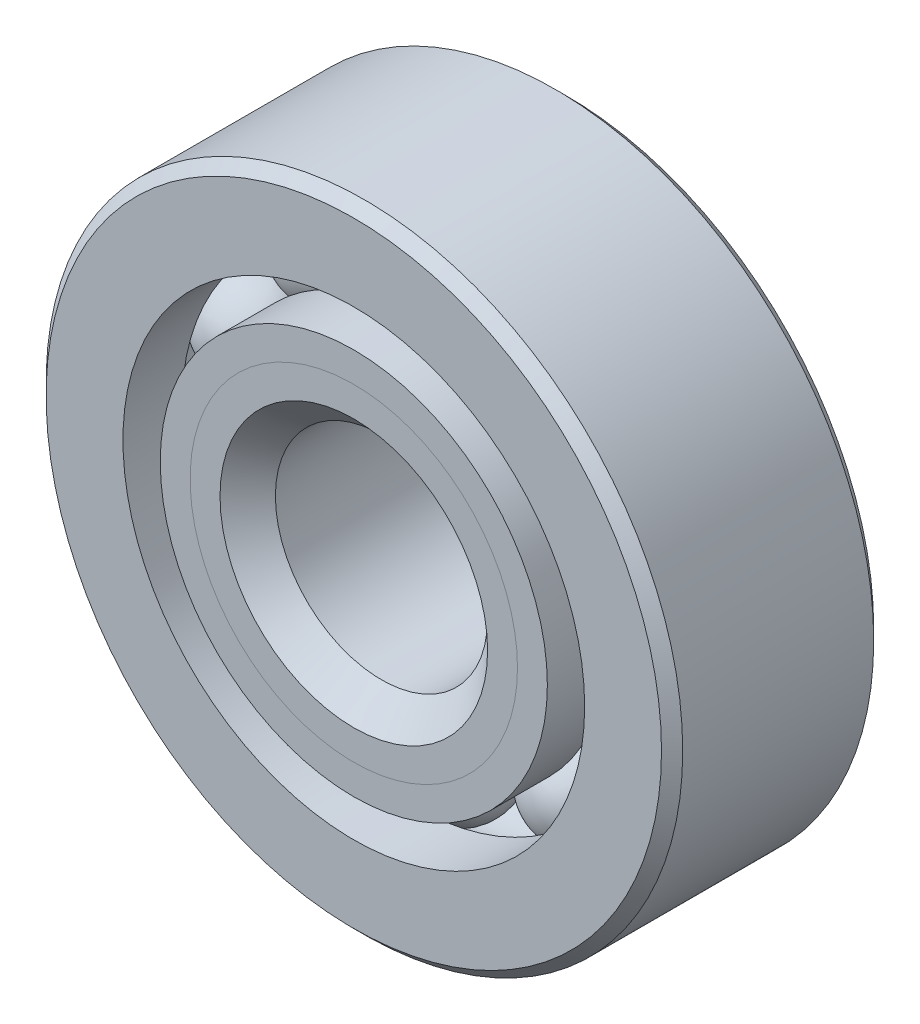
ISO-10303-21;
HEADER;
FILE_DESCRIPTION(('STEP AP214'),'2;1');
FILE_NAME('part.step','',(''),(''),'','','');
FILE_SCHEMA(('AUTOMOTIVE_DESIGN { 1 0 10303 214 1 1 1 1 }'));
ENDSEC;
DATA;
#1=APPLICATION_CONTEXT('core data for automotive mechanical design processes');
#2=APPLICATION_PROTOCOL_DEFINITION('international standard','automotive_design',2000,#1);
#3=PRODUCT_CONTEXT('',#1,'mechanical');
#4=PRODUCT('Part','Part','',(#3));
#5=PRODUCT_RELATED_PRODUCT_CATEGORY('part','',(#4));
#6=PRODUCT_DEFINITION_FORMATION('','',#4);
#7=PRODUCT_DEFINITION_CONTEXT('part definition',#1,'design');
#8=PRODUCT_DEFINITION('design','',#6,#7);
#9=PRODUCT_DEFINITION_SHAPE('','',#8);
#10=(LENGTH_UNIT() NAMED_UNIT(*) SI_UNIT(.MILLI.,.METRE.));
#11=(NAMED_UNIT(*) PLANE_ANGLE_UNIT() SI_UNIT($,.RADIAN.));
#12=(NAMED_UNIT(*) SI_UNIT($,.STERADIAN.) SOLID_ANGLE_UNIT());
#13=UNCERTAINTY_MEASURE_WITH_UNIT(LENGTH_MEASURE(1.E-05),#10,'distance_accuracy_value','');
#14=(GEOMETRIC_REPRESENTATION_CONTEXT(3) GLOBAL_UNCERTAINTY_ASSIGNED_CONTEXT((#13)) GLOBAL_UNIT_ASSIGNED_CONTEXT((#10,
#11,#12)) REPRESENTATION_CONTEXT('',''));
#15=CARTESIAN_POINT('',(0.,0.,0.));
#16=DIRECTION('',(0.,0.,1.));
#17=DIRECTION('',(1.,0.,0.));
#18=AXIS2_PLACEMENT_3D('',#15,#16,#17);
#19=CARTESIAN_POINT('',(-5.5986545280857,7.70588687142145,0.));
#20=DIRECTION('',(0.,0.,1.));
#21=DIRECTION('',(-0.587785252292462,0.809016994374955,0.));
#22=AXIS2_PLACEMENT_3D('',#19,#20,#21);
#23=SPHERICAL_SURFACE('',#22,2.27628073054021);
#24=CARTESIAN_POINT('',(-5.5986545280857,7.70588687142145,2.27628073054021));
#25=VERTEX_POINT('',#24);
#26=VERTEX_LOOP('',#25);
#27=FACE_BOUND('',#26,.T.);
#28=ADVANCED_FACE('F44',(#27),#23,.T.);
#29=CLOSED_SHELL('',(#28));
#30=MANIFOLD_SOLID_BREP('B2',#29);
#31=CARTESIAN_POINT('',(-9.05881331771131,2.94338687142148,0.));
#32=DIRECTION('',(0.,0.,1.));
#33=DIRECTION('',(-0.95105651629515,0.309016994374958,0.));
#34=AXIS2_PLACEMENT_3D('',#31,#32,#33);
#35=SPHERICAL_SURFACE('',#34,2.27628073054021);
#36=CARTESIAN_POINT('',(-9.05881331771131,2.94338687142148,2.27628073054021));
#37=VERTEX_POINT('',#36);
#38=VERTEX_LOOP('',#37);
#39=FACE_BOUND('',#38,.T.);
#40=ADVANCED_FACE('F81',(#39),#35,.T.);
#41=CLOSED_SHELL('',(#40));
#42=MANIFOLD_SOLID_BREP('B6',#41);
#43=CARTESIAN_POINT('',(-9.05881331771137,-2.94338687142129,0.));
#44=DIRECTION('',(0.,0.,1.));
#45=DIRECTION('',(-0.951056516295157,-0.309016994374938,0.));
#46=AXIS2_PLACEMENT_3D('',#43,#44,#45);
#47=SPHERICAL_SURFACE('',#46,2.27628073054021);
#48=CARTESIAN_POINT('',(-9.05881331771137,-2.94338687142129,2.27628073054021));
#49=VERTEX_POINT('',#48);
#50=VERTEX_LOOP('',#49);
#51=FACE_BOUND('',#50,.T.);
#52=ADVANCED_FACE('F118',(#51),#47,.T.);
#53=CLOSED_SHELL('',(#52));
#54=MANIFOLD_SOLID_BREP('B40',#53);
#55=CARTESIAN_POINT('',(-5.59865452808587,-7.70588687142132,0.));
#56=DIRECTION('',(0.,0.,1.));
#57=DIRECTION('',(-0.58778525229248,-0.809016994374942,0.));
#58=AXIS2_PLACEMENT_3D('',#55,#56,#57);
#59=SPHERICAL_SURFACE('',#58,2.27628073054021);
#60=CARTESIAN_POINT('',(-5.59865452808587,-7.70588687142132,2.27628073054021));
#61=VERTEX_POINT('',#60);
#62=VERTEX_LOOP('',#61);
#63=FACE_BOUND('',#62,.T.);
#64=ADVANCED_FACE('F155',(#63),#59,.T.);
#65=CLOSED_SHELL('',(#64));
#66=MANIFOLD_SOLID_BREP('B77',#65);
#67=CARTESIAN_POINT('',(0.,-9.525,0.));
#68=DIRECTION('',(0.,0.,1.));
#69=DIRECTION('',(0.,-1.,0.));
#70=AXIS2_PLACEMENT_3D('',#67,#68,#69);
#71=SPHERICAL_SURFACE('',#70,2.27628073054021);
#72=CARTESIAN_POINT('',(0.,-9.525,2.27628073054021));
#73=VERTEX_POINT('',#72);
#74=VERTEX_LOOP('',#73);
#75=FACE_BOUND('',#74,.T.);
#76=ADVANCED_FACE('F192',(#75),#71,.T.);
#77=CLOSED_SHELL('',(#76));
#78=MANIFOLD_SOLID_BREP('B114',#77);
#79=CARTESIAN_POINT('',(5.59865452808576,-7.70588687142141,0.));
#80=DIRECTION('',(0.,0.,1.));
#81=DIRECTION('',(0.587785252292469,-0.809016994374951,0.));
#82=AXIS2_PLACEMENT_3D('',#79,#80,#81);
#83=SPHERICAL_SURFACE('',#82,2.27628073054021);
#84=CARTESIAN_POINT('',(5.59865452808576,-7.70588687142141,2.27628073054021));
#85=VERTEX_POINT('',#84);
#86=VERTEX_LOOP('',#85);
#87=FACE_BOUND('',#86,.T.);
#88=ADVANCED_FACE('F229',(#87),#83,.T.);
#89=CLOSED_SHELL('',(#88));
#90=MANIFOLD_SOLID_BREP('B151',#89);
#91=CARTESIAN_POINT('',(9.05881331771133,-2.94338687142141,0.));
#92=DIRECTION('',(0.,0.,1.));
#93=DIRECTION('',(0.951056516295152,-0.309016994374952,0.));
#94=AXIS2_PLACEMENT_3D('',#91,#92,#93);
#95=SPHERICAL_SURFACE('',#94,2.27628073054021);
#96=CARTESIAN_POINT('',(9.05881331771133,-2.94338687142141,2.27628073054021));
#97=VERTEX_POINT('',#96);
#98=VERTEX_LOOP('',#97);
#99=FACE_BOUND('',#98,.T.);
#100=ADVANCED_FACE('F264',(#99),#95,.T.);
#101=CLOSED_SHELL('',(#100));
#102=MANIFOLD_SOLID_BREP('B188',#101);
#103=CARTESIAN_POINT('',(9.05881331771135,2.94338687142135,0.));
#104=DIRECTION('',(0.,0.,1.));
#105=DIRECTION('',(0.951056516295155,0.309016994374945,0.));
#106=AXIS2_PLACEMENT_3D('',#103,#104,#105);
#107=SPHERICAL_SURFACE('',#106,2.27628073054021);
#108=CARTESIAN_POINT('',(9.05881331771135,2.94338687142135,2.27628073054021));
#109=VERTEX_POINT('',#108);
#110=VERTEX_LOOP('',#109);
#111=FACE_BOUND('',#110,.T.);
#112=ADVANCED_FACE('F301',(#111),#107,.T.);
#113=CLOSED_SHELL('',(#112));
#114=MANIFOLD_SOLID_BREP('B225',#113);
#115=CARTESIAN_POINT('',(5.59865452808582,7.70588687142137,0.));
#116=DIRECTION('',(0.,0.,1.));
#117=DIRECTION('',(0.587785252292474,0.809016994374947,0.));
#118=AXIS2_PLACEMENT_3D('',#115,#116,#117);
#119=SPHERICAL_SURFACE('',#118,2.27628073054021);
#120=CARTESIAN_POINT('',(5.59865452808582,7.70588687142137,2.27628073054021));
#121=VERTEX_POINT('',#120);
#122=VERTEX_LOOP('',#121);
#123=FACE_BOUND('',#122,.T.);
#124=ADVANCED_FACE('F338',(#123),#119,.T.);
#125=CLOSED_SHELL('',(#124));
#126=MANIFOLD_SOLID_BREP('B260',#125);
#127=CARTESIAN_POINT('',(0.,9.525,0.));
#128=DIRECTION('',(0.,0.,1.));
#129=DIRECTION('',(0.,1.,0.));
#130=AXIS2_PLACEMENT_3D('',#127,#128,#129);
#131=SPHERICAL_SURFACE('',#130,2.27628073054021);
#132=CARTESIAN_POINT('',(0.,9.525,2.27628073054021));
#133=VERTEX_POINT('',#132);
#134=VERTEX_LOOP('',#133);
#135=FACE_BOUND('',#134,.T.);
#136=ADVANCED_FACE('F377',(#135),#131,.T.);
#137=CLOSED_SHELL('',(#136));
#138=MANIFOLD_SOLID_BREP('B297',#137);
#139=CARTESIAN_POINT('',(0.,7.34662349868363,4.7625));
#140=DIRECTION('',(0.,0.,-1.));
#141=DIRECTION('',(-1.,0.,0.));
#142=AXIS2_PLACEMENT_3D('',#139,#140,#141);
#143=PLANE('',#142);
#144=CARTESIAN_POINT('',(0.,0.,4.7625));
#145=DIRECTION('',(0.,0.,1.));
#146=DIRECTION('',(1.,0.,0.));
#147=AXIS2_PLACEMENT_3D('',#144,#145,#146);
#148=CIRCLE('',#147,6.00560963472989);
#149=CARTESIAN_POINT('',(6.00560963472989,0.,4.7625));
#150=VERTEX_POINT('',#149);
#151=EDGE_CURVE('E434',#150,#150,#148,.T.);
#152=ORIENTED_EDGE('',*,*,#151,.F.);
#153=EDGE_LOOP('',(#152));
#154=FACE_BOUND('',#153,.T.);
#155=CARTESIAN_POINT('',(0.,0.,4.7625));
#156=DIRECTION('',(0.,0.,1.));
#157=DIRECTION('',(1.,0.,0.));
#158=AXIS2_PLACEMENT_3D('',#155,#156,#157);
#159=CIRCLE('',#158,7.34662349868363);
#160=CARTESIAN_POINT('',(7.34662349868363,0.,4.7625));
#161=VERTEX_POINT('',#160);
#162=EDGE_CURVE('E376',#161,#161,#159,.T.);
#163=ORIENTED_EDGE('',*,*,#162,.T.);
#164=EDGE_LOOP('',(#163));
#165=FACE_BOUND('',#164,.T.);
#166=ADVANCED_FACE('F400',(#154,#165),#143,.F.);
#167=CARTESIAN_POINT('',(0.,0.,3.42148613604627));
#168=DIRECTION('',(0.,0.,1.));
#169=DIRECTION('',(1.,0.,0.));
#170=AXIS2_PLACEMENT_3D('',#167,#168,#169);
#171=CONICAL_SURFACE('',#170,6.00560963472989,0.78539816339745);
#172=ORIENTED_EDGE('',*,*,#162,.F.);
#173=EDGE_LOOP('',(#172));
#174=FACE_BOUND('',#173,.T.);
#175=CARTESIAN_POINT('',(0.,0.,3.42148613604627));
#176=DIRECTION('',(0.,0.,1.));
#177=DIRECTION('',(1.,0.,0.));
#178=AXIS2_PLACEMENT_3D('',#175,#176,#177);
#179=CIRCLE('',#178,6.00560963472989);
#180=CARTESIAN_POINT('',(6.00560963472989,0.,3.42148613604627));
#181=VERTEX_POINT('',#180);
#182=EDGE_CURVE('E406',#181,#181,#179,.T.);
#183=ORIENTED_EDGE('',*,*,#182,.T.);
#184=EDGE_LOOP('',(#183));
#185=FACE_BOUND('',#184,.T.);
#186=ADVANCED_FACE('F441',(#174,#185),#171,.T.);
#187=CARTESIAN_POINT('',(0.,0.,4.7625));
#188=DIRECTION('',(0.,0.,1.));
#189=DIRECTION('',(1.,0.,0.));
#190=AXIS2_PLACEMENT_3D('',#187,#188,#189);
#191=CYLINDRICAL_SURFACE('',#190,6.00560963472989);
#192=ORIENTED_EDGE('',*,*,#182,.F.);
#193=EDGE_LOOP('',(#192));
#194=FACE_BOUND('',#193,.T.);
#195=CARTESIAN_POINT('',(0.,0.,0.));
#196=DIRECTION('',(0.,0.,1.));
#197=DIRECTION('',(1.,0.,0.));
#198=AXIS2_PLACEMENT_3D('',#195,#196,#197);
#199=CIRCLE('',#198,6.00560963472989);
#200=CARTESIAN_POINT('',(6.00560963472989,0.,0.));
#201=VERTEX_POINT('',#200);
#202=EDGE_CURVE('E410',#201,#201,#199,.T.);
#203=ORIENTED_EDGE('',*,*,#202,.T.);
#204=EDGE_LOOP('',(#203));
#205=FACE_BOUND('',#204,.T.);
#206=ADVANCED_FACE('F445',(#194,#205),#191,.T.);
#207=CARTESIAN_POINT('',(0.,6.00560963472989,0.));
#208=DIRECTION('',(0.,0.,-1.));
#209=DIRECTION('',(-1.,0.,0.));
#210=AXIS2_PLACEMENT_3D('',#207,#208,#209);
#211=PLANE('',#210);
#212=ORIENTED_EDGE('',*,*,#202,.F.);
#213=EDGE_LOOP('',(#212));
#214=FACE_BOUND('',#213,.T.);
#215=CARTESIAN_POINT('',(0.,0.,0.));
#216=DIRECTION('',(0.,0.,1.));
#217=DIRECTION('',(1.,0.,0.));
#218=AXIS2_PLACEMENT_3D('',#215,#216,#217);
#219=CIRCLE('',#218,7.24871926945979);
#220=CARTESIAN_POINT('',(7.24871926945979,0.,0.));
#221=VERTEX_POINT('',#220);
#222=EDGE_CURVE('E414',#221,#221,#219,.T.);
#223=ORIENTED_EDGE('',*,*,#222,.T.);
#224=EDGE_LOOP('',(#223));
#225=FACE_BOUND('',#224,.T.);
#226=ADVANCED_FACE('F450',(#214,#225),#211,.F.);
#227=CARTESIAN_POINT('',(0.,0.,0.));
#228=DIRECTION('',(0.,0.,1.));
#229=DIRECTION('',(1.,0.,0.));
#230=AXIS2_PLACEMENT_3D('',#227,#228,#229);
#231=TOROIDAL_SURFACE('',#230,9.525,2.27628073054021);
#232=ORIENTED_EDGE('',*,*,#222,.F.);
#233=EDGE_LOOP('',(#232));
#234=FACE_BOUND('',#233,.T.);
#235=CARTESIAN_POINT('',(0.,0.,-2.11666666666667));
#236=DIRECTION('',(0.,0.,1.));
#237=DIRECTION('',(1.,0.,0.));
#238=AXIS2_PLACEMENT_3D('',#235,#236,#237);
#239=CIRCLE('',#238,8.68763736263737);
#240=CARTESIAN_POINT('',(8.68763736263737,0.,-2.11666666666667));
#241=VERTEX_POINT('',#240);
#242=EDGE_CURVE('E419',#241,#241,#239,.T.);
#243=ORIENTED_EDGE('',*,*,#242,.T.);
#244=EDGE_LOOP('',(#243));
#245=FACE_BOUND('',#244,.T.);
#246=ADVANCED_FACE('F456',(#234,#245),#231,.F.);
#247=CARTESIAN_POINT('',(0.,0.,4.7625));
#248=DIRECTION('',(0.,0.,1.));
#249=DIRECTION('',(1.,0.,0.));
#250=AXIS2_PLACEMENT_3D('',#247,#248,#249);
#251=CYLINDRICAL_SURFACE('',#250,8.68763736263737);
#252=ORIENTED_EDGE('',*,*,#242,.F.);
#253=EDGE_LOOP('',(#252));
#254=FACE_BOUND('',#253,.T.);
#255=CARTESIAN_POINT('',(0.,0.,-4.76250000000001));
#256=DIRECTION('',(0.,0.,1.));
#257=DIRECTION('',(1.,0.,0.));
#258=AXIS2_PLACEMENT_3D('',#255,#256,#257);
#259=CIRCLE('',#258,8.68763736263737);
#260=CARTESIAN_POINT('',(8.68763736263737,0.,-4.76250000000001));
#261=VERTEX_POINT('',#260);
#262=EDGE_CURVE('E422',#261,#261,#259,.T.);
#263=ORIENTED_EDGE('',*,*,#262,.T.);
#264=EDGE_LOOP('',(#263));
#265=FACE_BOUND('',#264,.T.);
#266=ADVANCED_FACE('F460',(#254,#265),#251,.T.);
#267=CARTESIAN_POINT('',(0.,5.23875,-4.7625));
#268=DIRECTION('',(0.,0.,1.));
#269=DIRECTION('',(1.,0.,0.));
#270=AXIS2_PLACEMENT_3D('',#267,#268,#269);
#271=PLANE('',#270);
#272=ORIENTED_EDGE('',*,*,#262,.F.);
#273=EDGE_LOOP('',(#272));
#274=FACE_BOUND('',#273,.T.);
#275=CARTESIAN_POINT('',(0.,0.,-4.7625));
#276=DIRECTION('',(0.,0.,1.));
#277=DIRECTION('',(1.,0.,0.));
#278=AXIS2_PLACEMENT_3D('',#275,#276,#277);
#279=CIRCLE('',#278,5.23875);
#280=CARTESIAN_POINT('',(5.23875,0.,-4.7625));
#281=VERTEX_POINT('',#280);
#282=EDGE_CURVE('E425',#281,#281,#279,.T.);
#283=ORIENTED_EDGE('',*,*,#282,.T.);
#284=EDGE_LOOP('',(#283));
#285=FACE_BOUND('',#284,.T.);
#286=ADVANCED_FACE('F464',(#274,#285),#271,.F.);
#287=CARTESIAN_POINT('',(0.,0.,-4.28625));
#288=DIRECTION('',(0.,0.,-1.));
#289=DIRECTION('',(-1.,0.,0.));
#290=AXIS2_PLACEMENT_3D('',#287,#288,#289);
#291=CONICAL_SURFACE('',#290,4.7625,0.785398163397447);
#292=ORIENTED_EDGE('',*,*,#282,.F.);
#293=EDGE_LOOP('',(#292));
#294=FACE_BOUND('',#293,.T.);
#295=CARTESIAN_POINT('',(0.,0.,-4.28625));
#296=DIRECTION('',(0.,0.,1.));
#297=DIRECTION('',(1.,0.,0.));
#298=AXIS2_PLACEMENT_3D('',#295,#296,#297);
#299=CIRCLE('',#298,4.7625);
#300=CARTESIAN_POINT('',(4.7625,0.,-4.28625));
#301=VERTEX_POINT('',#300);
#302=EDGE_CURVE('E428',#301,#301,#299,.T.);
#303=ORIENTED_EDGE('',*,*,#302,.T.);
#304=EDGE_LOOP('',(#303));
#305=FACE_BOUND('',#304,.T.);
#306=ADVANCED_FACE('F468',(#294,#305),#291,.F.);
#307=CARTESIAN_POINT('',(0.,0.,4.7625));
#308=DIRECTION('',(0.,0.,1.));
#309=DIRECTION('',(1.,0.,0.));
#310=AXIS2_PLACEMENT_3D('',#307,#308,#309);
#311=CYLINDRICAL_SURFACE('',#310,4.7625);
#312=ORIENTED_EDGE('',*,*,#302,.F.);
#313=EDGE_LOOP('',(#312));
#314=FACE_BOUND('',#313,.T.);
#315=CARTESIAN_POINT('',(0.,0.,3.51939036527011));
#316=DIRECTION('',(0.,0.,1.));
#317=DIRECTION('',(1.,0.,0.));
#318=AXIS2_PLACEMENT_3D('',#315,#316,#317);
#319=CIRCLE('',#318,4.7625);
#320=CARTESIAN_POINT('',(4.7625,0.,3.51939036527011));
#321=VERTEX_POINT('',#320);
#322=EDGE_CURVE('E431',#321,#321,#319,.T.);
#323=ORIENTED_EDGE('',*,*,#322,.T.);
#324=EDGE_LOOP('',(#323));
#325=FACE_BOUND('',#324,.T.);
#326=ADVANCED_FACE('F472',(#314,#325),#311,.F.);
#327=CARTESIAN_POINT('',(0.,0.,4.7625));
#328=DIRECTION('',(0.,0.,1.));
#329=DIRECTION('',(1.,0.,0.));
#330=AXIS2_PLACEMENT_3D('',#327,#328,#329);
#331=CONICAL_SURFACE('',#330,6.00560963472989,0.785398163397451);
#332=ORIENTED_EDGE('',*,*,#322,.F.);
#333=EDGE_LOOP('',(#332));
#334=FACE_BOUND('',#333,.T.);
#335=ORIENTED_EDGE('',*,*,#151,.T.);
#336=EDGE_LOOP('',(#335));
#337=FACE_BOUND('',#336,.T.);
#338=ADVANCED_FACE('F438',(#334,#337),#331,.F.);
#339=CLOSED_SHELL('',(#166,#186,#206,#226,#246,#266,#286,#306,#326,#338));
#340=MANIFOLD_SOLID_BREP('B334',#339);
#341=CARTESIAN_POINT('',(0.,8.68763736263737,4.7625));
#342=DIRECTION('',(0.,0.,-1.));
#343=DIRECTION('',(-1.,0.,0.));
#344=AXIS2_PLACEMENT_3D('',#341,#342,#343);
#345=PLANE('',#344);
#346=CARTESIAN_POINT('',(0.,0.,4.7625));
#347=DIRECTION('',(0.,0.,1.));
#348=DIRECTION('',(1.,0.,0.));
#349=AXIS2_PLACEMENT_3D('',#346,#347,#348);
#350=CIRCLE('',#349,7.34662349868363);
#351=CARTESIAN_POINT('',(7.34662349868363,0.,4.7625));
#352=VERTEX_POINT('',#351);
#353=EDGE_CURVE('E399',#352,#352,#350,.T.);
#354=ORIENTED_EDGE('',*,*,#353,.F.);
#355=EDGE_LOOP('',(#354));
#356=FACE_BOUND('',#355,.T.);
#357=CARTESIAN_POINT('',(0.,0.,4.7625));
#358=DIRECTION('',(0.,0.,1.));
#359=DIRECTION('',(1.,0.,0.));
#360=AXIS2_PLACEMENT_3D('',#357,#358,#359);
#361=CIRCLE('',#360,8.68763736263737);
#362=CARTESIAN_POINT('',(8.68763736263737,0.,4.7625));
#363=VERTEX_POINT('',#362);
#364=EDGE_CURVE('E583',#363,#363,#361,.T.);
#365=ORIENTED_EDGE('',*,*,#364,.T.);
#366=EDGE_LOOP('',(#365));
#367=FACE_BOUND('',#366,.T.);
#368=ADVANCED_FACE('F561',(#356,#367),#345,.F.);
#369=CARTESIAN_POINT('',(0.,0.,4.7625));
#370=DIRECTION('',(0.,0.,1.));
#371=DIRECTION('',(1.,0.,0.));
#372=AXIS2_PLACEMENT_3D('',#369,#370,#371);
#373=CONICAL_SURFACE('',#372,7.34662349868363,0.78539816339745);
#374=CARTESIAN_POINT('',(0.,0.,3.42148613604627));
#375=DIRECTION('',(0.,0.,1.));
#376=DIRECTION('',(1.,0.,0.));
#377=AXIS2_PLACEMENT_3D('',#374,#375,#376);
#378=CIRCLE('',#377,6.00560963472989);
#379=CARTESIAN_POINT('',(6.00560963472989,0.,3.42148613604627));
#380=VERTEX_POINT('',#379);
#381=EDGE_CURVE('E567',#380,#380,#378,.T.);
#382=ORIENTED_EDGE('',*,*,#381,.F.);
#383=EDGE_LOOP('',(#382));
#384=FACE_BOUND('',#383,.T.);
#385=ORIENTED_EDGE('',*,*,#353,.T.);
#386=EDGE_LOOP('',(#385));
#387=FACE_BOUND('',#386,.T.);
#388=ADVANCED_FACE('F608',(#384,#387),#373,.F.);
#389=CARTESIAN_POINT('',(0.,0.,4.7625));
#390=DIRECTION('',(0.,0.,1.));
#391=DIRECTION('',(1.,0.,0.));
#392=AXIS2_PLACEMENT_3D('',#389,#390,#391);
#393=CYLINDRICAL_SURFACE('',#392,6.00560963472989);
#394=CARTESIAN_POINT('',(0.,0.,0.));
#395=DIRECTION('',(0.,0.,1.));
#396=DIRECTION('',(1.,0.,0.));
#397=AXIS2_PLACEMENT_3D('',#394,#395,#396);
#398=CIRCLE('',#397,6.00560963472989);
#399=CARTESIAN_POINT('',(6.00560963472989,0.,0.));
#400=VERTEX_POINT('',#399);
#401=EDGE_CURVE('E571',#400,#400,#398,.T.);
#402=ORIENTED_EDGE('',*,*,#401,.F.);
#403=EDGE_LOOP('',(#402));
#404=FACE_BOUND('',#403,.T.);
#405=ORIENTED_EDGE('',*,*,#381,.T.);
#406=EDGE_LOOP('',(#405));
#407=FACE_BOUND('',#406,.T.);
#408=ADVANCED_FACE('F603',(#404,#407),#393,.F.);
#409=CARTESIAN_POINT('',(0.,6.00560963472989,0.));
#410=DIRECTION('',(0.,0.,1.));
#411=DIRECTION('',(1.,0.,0.));
#412=AXIS2_PLACEMENT_3D('',#409,#410,#411);
#413=PLANE('',#412);
#414=CARTESIAN_POINT('',(0.,0.,0.));
#415=DIRECTION('',(0.,0.,1.));
#416=DIRECTION('',(1.,0.,0.));
#417=AXIS2_PLACEMENT_3D('',#414,#415,#416);
#418=CIRCLE('',#417,7.24871926945979);
#419=CARTESIAN_POINT('',(7.24871926945979,0.,0.));
#420=VERTEX_POINT('',#419);
#421=EDGE_CURVE('E575',#420,#420,#418,.T.);
#422=ORIENTED_EDGE('',*,*,#421,.F.);
#423=EDGE_LOOP('',(#422));
#424=FACE_BOUND('',#423,.T.);
#425=ORIENTED_EDGE('',*,*,#401,.T.);
#426=EDGE_LOOP('',(#425));
#427=FACE_BOUND('',#426,.T.);
#428=ADVANCED_FACE('F597',(#424,#427),#413,.F.);
#429=CARTESIAN_POINT('',(0.,0.,0.));
#430=DIRECTION('',(0.,0.,1.));
#431=DIRECTION('',(1.,0.,0.));
#432=AXIS2_PLACEMENT_3D('',#429,#430,#431);
#433=TOROIDAL_SURFACE('',#432,9.525,2.27628073054021);
#434=CARTESIAN_POINT('',(0.,0.,2.11666666666666));
#435=DIRECTION('',(0.,0.,1.));
#436=DIRECTION('',(1.,0.,0.));
#437=AXIS2_PLACEMENT_3D('',#434,#435,#436);
#438=CIRCLE('',#437,8.68763736263737);
#439=CARTESIAN_POINT('',(8.68763736263737,0.,2.11666666666666));
#440=VERTEX_POINT('',#439);
#441=EDGE_CURVE('E580',#440,#440,#438,.T.);
#442=ORIENTED_EDGE('',*,*,#441,.F.);
#443=EDGE_LOOP('',(#442));
#444=FACE_BOUND('',#443,.T.);
#445=ORIENTED_EDGE('',*,*,#421,.T.);
#446=EDGE_LOOP('',(#445));
#447=FACE_BOUND('',#446,.T.);
#448=ADVANCED_FACE('F591',(#444,#447),#433,.F.);
#449=CARTESIAN_POINT('',(0.,0.,4.7625));
#450=DIRECTION('',(0.,0.,1.));
#451=DIRECTION('',(1.,0.,0.));
#452=AXIS2_PLACEMENT_3D('',#449,#450,#451);
#453=CYLINDRICAL_SURFACE('',#452,8.68763736263737);
#454=ORIENTED_EDGE('',*,*,#364,.F.);
#455=EDGE_LOOP('',(#454));
#456=FACE_BOUND('',#455,.T.);
#457=ORIENTED_EDGE('',*,*,#441,.T.);
#458=EDGE_LOOP('',(#457));
#459=FACE_BOUND('',#458,.T.);
#460=ADVANCED_FACE('F588',(#456,#459),#453,.T.);
#461=CLOSED_SHELL('',(#368,#388,#408,#428,#448,#460));
#462=MANIFOLD_SOLID_BREP('B371',#461);
#463=CARTESIAN_POINT('',(0.,0.,4.28625));
#464=DIRECTION('',(0.,0.,-1.));
#465=DIRECTION('',(-1.,0.,0.));
#466=AXIS2_PLACEMENT_3D('',#463,#464,#465);
#467=CONICAL_SURFACE('',#466,14.2875,0.785398163397446);
#468=CARTESIAN_POINT('',(0.,0.,4.7625));
#469=DIRECTION('',(0.,0.,1.));
#470=DIRECTION('',(1.,0.,0.));
#471=AXIS2_PLACEMENT_3D('',#468,#469,#470);
#472=CIRCLE('',#471,13.81125);
#473=CARTESIAN_POINT('',(13.81125,0.,4.7625));
#474=VERTEX_POINT('',#473);
#475=EDGE_CURVE('E683',#474,#474,#472,.T.);
#476=ORIENTED_EDGE('',*,*,#475,.F.);
#477=EDGE_LOOP('',(#476));
#478=FACE_BOUND('',#477,.T.);
#479=CARTESIAN_POINT('',(0.,0.,4.28625));
#480=DIRECTION('',(0.,0.,1.));
#481=DIRECTION('',(1.,0.,0.));
#482=AXIS2_PLACEMENT_3D('',#479,#480,#481);
#483=CIRCLE('',#482,14.2875);
#484=CARTESIAN_POINT('',(14.2875,0.,4.28625));
#485=VERTEX_POINT('',#484);
#486=EDGE_CURVE('E560',#485,#485,#483,.T.);
#487=ORIENTED_EDGE('',*,*,#486,.T.);
#488=EDGE_LOOP('',(#487));
#489=FACE_BOUND('',#488,.T.);
#490=ADVANCED_FACE('F655',(#478,#489),#467,.T.);
#491=CARTESIAN_POINT('',(0.,0.,4.7625));
#492=DIRECTION('',(0.,0.,1.));
#493=DIRECTION('',(1.,0.,0.));
#494=AXIS2_PLACEMENT_3D('',#491,#492,#493);
#495=CYLINDRICAL_SURFACE('',#494,14.2875);
#496=ORIENTED_EDGE('',*,*,#486,.F.);
#497=EDGE_LOOP('',(#496));
#498=FACE_BOUND('',#497,.T.);
#499=CARTESIAN_POINT('',(0.,0.,-4.28625));
#500=DIRECTION('',(0.,0.,1.));
#501=DIRECTION('',(1.,0.,0.));
#502=AXIS2_PLACEMENT_3D('',#499,#500,#501);
#503=CIRCLE('',#502,14.2875);
#504=CARTESIAN_POINT('',(14.2875,0.,-4.28625));
#505=VERTEX_POINT('',#504);
#506=EDGE_CURVE('E661',#505,#505,#503,.T.);
#507=ORIENTED_EDGE('',*,*,#506,.T.);
#508=EDGE_LOOP('',(#507));
#509=FACE_BOUND('',#508,.T.);
#510=ADVANCED_FACE('F690',(#498,#509),#495,.T.);
#511=CARTESIAN_POINT('',(0.,0.,-4.76250000000001));
#512=DIRECTION('',(0.,0.,1.));
#513=DIRECTION('',(1.,0.,0.));
#514=AXIS2_PLACEMENT_3D('',#511,#512,#513);
#515=CONICAL_SURFACE('',#514,13.81125,0.785398163397439);
#516=ORIENTED_EDGE('',*,*,#506,.F.);
#517=EDGE_LOOP('',(#516));
#518=FACE_BOUND('',#517,.T.);
#519=CARTESIAN_POINT('',(0.,0.,-4.76250000000001));
#520=DIRECTION('',(0.,0.,1.));
#521=DIRECTION('',(1.,0.,0.));
#522=AXIS2_PLACEMENT_3D('',#519,#520,#521);
#523=CIRCLE('',#522,13.81125);
#524=CARTESIAN_POINT('',(13.81125,0.,-4.76250000000001));
#525=VERTEX_POINT('',#524);
#526=EDGE_CURVE('E665',#525,#525,#523,.T.);
#527=ORIENTED_EDGE('',*,*,#526,.T.);
#528=EDGE_LOOP('',(#527));
#529=FACE_BOUND('',#528,.T.);
#530=ADVANCED_FACE('F694',(#518,#529),#515,.T.);
#531=CARTESIAN_POINT('',(0.,13.81125,-4.76250000000001));
#532=DIRECTION('',(0.,0.,1.));
#533=DIRECTION('',(1.,0.,0.));
#534=AXIS2_PLACEMENT_3D('',#531,#532,#533);
#535=PLANE('',#534);
#536=ORIENTED_EDGE('',*,*,#526,.F.);
#537=EDGE_LOOP('',(#536));
#538=FACE_BOUND('',#537,.T.);
#539=CARTESIAN_POINT('',(0.,0.,-4.76250000000001));
#540=DIRECTION('',(0.,0.,1.));
#541=DIRECTION('',(1.,0.,0.));
#542=AXIS2_PLACEMENT_3D('',#539,#540,#541);
#543=CIRCLE('',#542,10.3623626373626);
#544=CARTESIAN_POINT('',(10.3623626373626,0.,-4.76250000000001));
#545=VERTEX_POINT('',#544);
#546=EDGE_CURVE('E669',#545,#545,#543,.T.);
#547=ORIENTED_EDGE('',*,*,#546,.T.);
#548=EDGE_LOOP('',(#547));
#549=FACE_BOUND('',#548,.T.);
#550=ADVANCED_FACE('F699',(#538,#549),#535,.F.);
#551=CARTESIAN_POINT('',(0.,0.,4.7625));
#552=DIRECTION('',(0.,0.,1.));
#553=DIRECTION('',(1.,0.,0.));
#554=AXIS2_PLACEMENT_3D('',#551,#552,#553);
#555=CYLINDRICAL_SURFACE('',#554,10.3623626373626);
#556=ORIENTED_EDGE('',*,*,#546,.F.);
#557=EDGE_LOOP('',(#556));
#558=FACE_BOUND('',#557,.T.);
#559=CARTESIAN_POINT('',(0.,0.,-2.11666666666667));
#560=DIRECTION('',(0.,0.,1.));
#561=DIRECTION('',(1.,0.,0.));
#562=AXIS2_PLACEMENT_3D('',#559,#560,#561);
#563=CIRCLE('',#562,10.3623626373626);
#564=CARTESIAN_POINT('',(10.3623626373626,0.,-2.11666666666667));
#565=VERTEX_POINT('',#564);
#566=EDGE_CURVE('E674',#565,#565,#563,.T.);
#567=ORIENTED_EDGE('',*,*,#566,.T.);
#568=EDGE_LOOP('',(#567));
#569=FACE_BOUND('',#568,.T.);
#570=ADVANCED_FACE('F705',(#558,#569),#555,.F.);
#571=CARTESIAN_POINT('',(0.,0.,0.));
#572=DIRECTION('',(0.,0.,1.));
#573=DIRECTION('',(1.,0.,0.));
#574=AXIS2_PLACEMENT_3D('',#571,#572,#573);
#575=TOROIDAL_SURFACE('',#574,9.525,2.27628073054021);
#576=ORIENTED_EDGE('',*,*,#566,.F.);
#577=EDGE_LOOP('',(#576));
#578=FACE_BOUND('',#577,.T.);
#579=CARTESIAN_POINT('',(0.,0.,2.11666666666666));
#580=DIRECTION('',(0.,0.,1.));
#581=DIRECTION('',(1.,0.,0.));
#582=AXIS2_PLACEMENT_3D('',#579,#580,#581);
#583=CIRCLE('',#582,10.3623626373626);
#584=CARTESIAN_POINT('',(10.3623626373626,0.,2.11666666666666));
#585=VERTEX_POINT('',#584);
#586=EDGE_CURVE('E677',#585,#585,#583,.T.);
#587=ORIENTED_EDGE('',*,*,#586,.T.);
#588=EDGE_LOOP('',(#587));
#589=FACE_BOUND('',#588,.T.);
#590=ADVANCED_FACE('F709',(#578,#589),#575,.F.);
#591=CARTESIAN_POINT('',(0.,0.,4.7625));
#592=DIRECTION('',(0.,0.,1.));
#593=DIRECTION('',(1.,0.,0.));
#594=AXIS2_PLACEMENT_3D('',#591,#592,#593);
#595=CYLINDRICAL_SURFACE('',#594,10.3623626373626);
#596=ORIENTED_EDGE('',*,*,#586,.F.);
#597=EDGE_LOOP('',(#596));
#598=FACE_BOUND('',#597,.T.);
#599=CARTESIAN_POINT('',(0.,0.,4.7625));
#600=DIRECTION('',(0.,0.,1.));
#601=DIRECTION('',(1.,0.,0.));
#602=AXIS2_PLACEMENT_3D('',#599,#600,#601);
#603=CIRCLE('',#602,10.3623626373626);
#604=CARTESIAN_POINT('',(10.3623626373626,0.,4.7625));
#605=VERTEX_POINT('',#604);
#606=EDGE_CURVE('E680',#605,#605,#603,.T.);
#607=ORIENTED_EDGE('',*,*,#606,.T.);
#608=EDGE_LOOP('',(#607));
#609=FACE_BOUND('',#608,.T.);
#610=ADVANCED_FACE('F713',(#598,#609),#595,.F.);
#611=CARTESIAN_POINT('',(0.,13.81125,4.7625));
#612=DIRECTION('',(0.,0.,-1.));
#613=DIRECTION('',(-1.,0.,0.));
#614=AXIS2_PLACEMENT_3D('',#611,#612,#613);
#615=PLANE('',#614);
#616=ORIENTED_EDGE('',*,*,#606,.F.);
#617=EDGE_LOOP('',(#616));
#618=FACE_BOUND('',#617,.T.);
#619=ORIENTED_EDGE('',*,*,#475,.T.);
#620=EDGE_LOOP('',(#619));
#621=FACE_BOUND('',#620,.T.);
#622=ADVANCED_FACE('F687',(#618,#621),#615,.F.);
#623=CLOSED_SHELL('',(#490,#510,#530,#550,#570,#590,#610,#622));
#624=MANIFOLD_SOLID_BREP('B394',#623);
#625=ADVANCED_BREP_SHAPE_REPRESENTATION('',(#18,#30,#42,#54,#66,#78,#90,#102,#114,#126,#138,
#340,#462,#624),#14);
#626=SHAPE_DEFINITION_REPRESENTATION(#9,#625);
ENDSEC;
END-ISO-10303-21;
